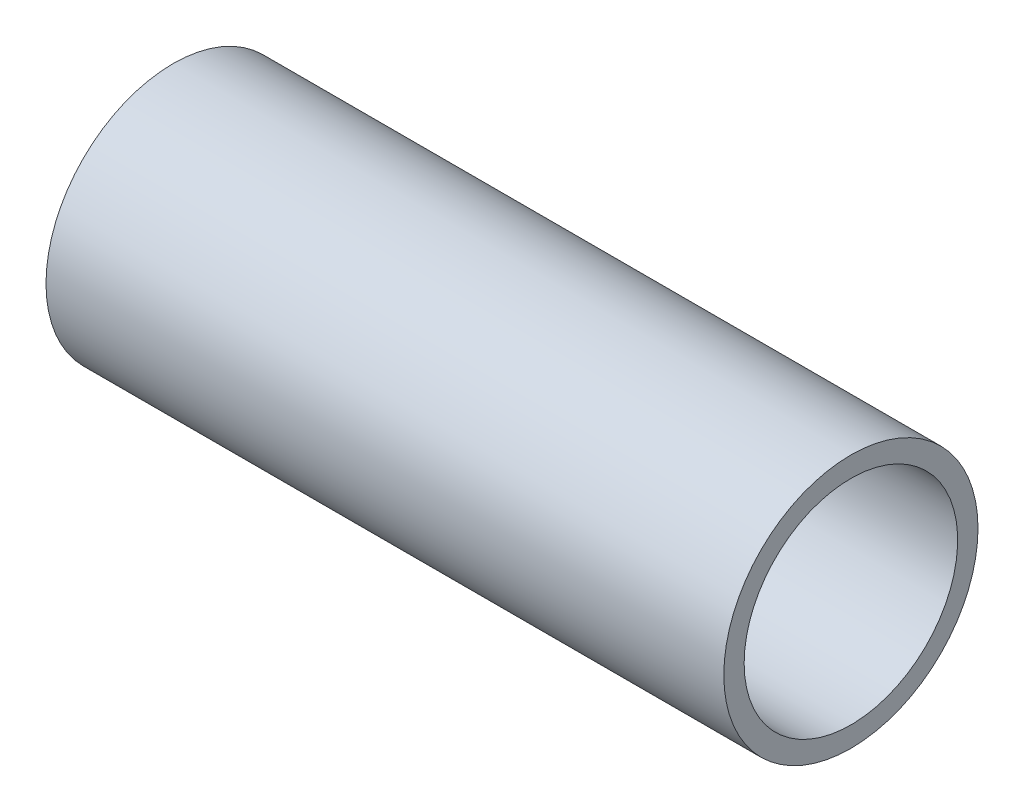
ISO-10303-21;
HEADER;
FILE_DESCRIPTION(('STEP AP214'),'2;1');
FILE_NAME('part.step','',(''),(''),'','','');
FILE_SCHEMA(('AUTOMOTIVE_DESIGN { 1 0 10303 214 1 1 1 1 }'));
ENDSEC;
DATA;
#1=APPLICATION_CONTEXT('core data for automotive mechanical design processes');
#2=APPLICATION_PROTOCOL_DEFINITION('international standard','automotive_design',2000,#1);
#3=PRODUCT_CONTEXT('',#1,'mechanical');
#4=PRODUCT('Part','Part','',(#3));
#5=PRODUCT_RELATED_PRODUCT_CATEGORY('part','',(#4));
#6=PRODUCT_DEFINITION_FORMATION('','',#4);
#7=PRODUCT_DEFINITION_CONTEXT('part definition',#1,'design');
#8=PRODUCT_DEFINITION('design','',#6,#7);
#9=PRODUCT_DEFINITION_SHAPE('','',#8);
#10=(LENGTH_UNIT() NAMED_UNIT(*) SI_UNIT(.MILLI.,.METRE.));
#11=(NAMED_UNIT(*) PLANE_ANGLE_UNIT() SI_UNIT($,.RADIAN.));
#12=(NAMED_UNIT(*) SI_UNIT($,.STERADIAN.) SOLID_ANGLE_UNIT());
#13=UNCERTAINTY_MEASURE_WITH_UNIT(LENGTH_MEASURE(1.E-05),#10,'distance_accuracy_value','');
#14=(GEOMETRIC_REPRESENTATION_CONTEXT(3) GLOBAL_UNCERTAINTY_ASSIGNED_CONTEXT((#13)) GLOBAL_UNIT_ASSIGNED_CONTEXT((#10,
#11,#12)) REPRESENTATION_CONTEXT('',''));
#15=CARTESIAN_POINT('',(0.,0.,0.));
#16=DIRECTION('',(0.,0.,1.));
#17=DIRECTION('',(1.,0.,0.));
#18=AXIS2_PLACEMENT_3D('',#15,#16,#17);
#19=CARTESIAN_POINT('',(50.8,0.,0.));
#20=DIRECTION('',(-1.,0.,0.));
#21=DIRECTION('',(0.,0.,1.));
#22=AXIS2_PLACEMENT_3D('',#19,#20,#21);
#23=CYLINDRICAL_SURFACE('',#22,9.525);
#24=CARTESIAN_POINT('',(50.8,0.,0.));
#25=DIRECTION('',(1.,0.,0.));
#26=DIRECTION('',(0.,0.,-1.));
#27=AXIS2_PLACEMENT_3D('',#24,#25,#26);
#28=CIRCLE('',#27,9.525);
#29=CARTESIAN_POINT('',(50.8,0.,-9.525));
#30=VERTEX_POINT('',#29);
#31=EDGE_CURVE('E10',#30,#30,#28,.T.);
#32=ORIENTED_EDGE('',*,*,#31,.F.);
#33=EDGE_LOOP('',(#32));
#34=FACE_BOUND('',#33,.T.);
#35=CARTESIAN_POINT('',(0.,0.,0.));
#36=DIRECTION('',(1.,0.,0.));
#37=DIRECTION('',(0.,0.,-1.));
#38=AXIS2_PLACEMENT_3D('',#35,#36,#37);
#39=CIRCLE('',#38,9.525);
#40=CARTESIAN_POINT('',(0.,0.,-9.525));
#41=VERTEX_POINT('',#40);
#42=EDGE_CURVE('E35',#41,#41,#39,.T.);
#43=ORIENTED_EDGE('',*,*,#42,.T.);
#44=EDGE_LOOP('',(#43));
#45=FACE_BOUND('',#44,.T.);
#46=ADVANCED_FACE('F32',(#34,#45),#23,.T.);
#47=CARTESIAN_POINT('',(50.8,0.,0.));
#48=DIRECTION('',(1.,0.,0.));
#49=DIRECTION('',(0.,0.,-1.));
#50=AXIS2_PLACEMENT_3D('',#47,#48,#49);
#51=PLANE('',#50);
#52=CARTESIAN_POINT('',(50.8,0.,0.));
#53=DIRECTION('',(-1.,0.,0.));
#54=DIRECTION('',(0.,0.,1.));
#55=AXIS2_PLACEMENT_3D('',#52,#53,#54);
#56=CIRCLE('',#55,8.001);
#57=CARTESIAN_POINT('',(50.8,0.,8.001));
#58=VERTEX_POINT('',#57);
#59=EDGE_CURVE('E47',#58,#58,#56,.T.);
#60=ORIENTED_EDGE('',*,*,#59,.T.);
#61=EDGE_LOOP('',(#60));
#62=FACE_BOUND('',#61,.T.);
#63=ORIENTED_EDGE('',*,*,#31,.T.);
#64=EDGE_LOOP('',(#63));
#65=FACE_BOUND('',#64,.T.);
#66=ADVANCED_FACE('F56',(#62,#65),#51,.T.);
#67=CARTESIAN_POINT('',(0.,0.,0.));
#68=DIRECTION('',(1.,0.,0.));
#69=DIRECTION('',(0.,0.,-1.));
#70=AXIS2_PLACEMENT_3D('',#67,#68,#69);
#71=PLANE('',#70);
#72=CARTESIAN_POINT('',(0.,0.,0.));
#73=DIRECTION('',(-1.,0.,0.));
#74=DIRECTION('',(0.,0.,1.));
#75=AXIS2_PLACEMENT_3D('',#72,#73,#74);
#76=CIRCLE('',#75,8.509);
#77=CARTESIAN_POINT('',(0.,0.,8.509));
#78=VERTEX_POINT('',#77);
#79=EDGE_CURVE('E44',#78,#78,#76,.T.);
#80=ORIENTED_EDGE('',*,*,#79,.F.);
#81=EDGE_LOOP('',(#80));
#82=FACE_BOUND('',#81,.T.);
#83=ORIENTED_EDGE('',*,*,#42,.F.);
#84=EDGE_LOOP('',(#83));
#85=FACE_BOUND('',#84,.T.);
#86=ADVANCED_FACE('F73',(#82,#85),#71,.F.);
#87=CARTESIAN_POINT('',(1.524,0.,0.));
#88=DIRECTION('',(-1.,0.,0.));
#89=DIRECTION('',(0.,0.,1.));
#90=AXIS2_PLACEMENT_3D('',#87,#88,#89);
#91=CYLINDRICAL_SURFACE('',#90,8.509);
#92=CARTESIAN_POINT('',(1.524,0.,0.));
#93=DIRECTION('',(-1.,0.,0.));
#94=DIRECTION('',(0.,0.,1.));
#95=AXIS2_PLACEMENT_3D('',#92,#93,#94);
#96=CIRCLE('',#95,8.509);
#97=CARTESIAN_POINT('',(1.524,0.,8.509));
#98=VERTEX_POINT('',#97);
#99=EDGE_CURVE('E42',#98,#98,#96,.T.);
#100=ORIENTED_EDGE('',*,*,#99,.F.);
#101=EDGE_LOOP('',(#100));
#102=FACE_BOUND('',#101,.T.);
#103=ORIENTED_EDGE('',*,*,#79,.T.);
#104=EDGE_LOOP('',(#103));
#105=FACE_BOUND('',#104,.T.);
#106=ADVANCED_FACE('F67',(#102,#105),#91,.F.);
#107=CARTESIAN_POINT('',(1.524,0.,0.));
#108=DIRECTION('',(-1.,0.,0.));
#109=DIRECTION('',(0.,0.,1.));
#110=AXIS2_PLACEMENT_3D('',#107,#108,#109);
#111=PLANE('',#110);
#112=CARTESIAN_POINT('',(1.524,0.,0.));
#113=DIRECTION('',(-1.,0.,0.));
#114=DIRECTION('',(0.,0.,1.));
#115=AXIS2_PLACEMENT_3D('',#112,#113,#114);
#116=CIRCLE('',#115,8.001);
#117=CARTESIAN_POINT('',(1.524,0.,8.001));
#118=VERTEX_POINT('',#117);
#119=EDGE_CURVE('E50',#118,#118,#116,.T.);
#120=ORIENTED_EDGE('',*,*,#119,.F.);
#121=EDGE_LOOP('',(#120));
#122=FACE_BOUND('',#121,.T.);
#123=ORIENTED_EDGE('',*,*,#99,.T.);
#124=EDGE_LOOP('',(#123));
#125=FACE_BOUND('',#124,.T.);
#126=ADVANCED_FACE('F61',(#122,#125),#111,.T.);
#127=CARTESIAN_POINT('',(50.8,0.,0.));
#128=DIRECTION('',(-1.,0.,0.));
#129=DIRECTION('',(0.,0.,1.));
#130=AXIS2_PLACEMENT_3D('',#127,#128,#129);
#131=CYLINDRICAL_SURFACE('',#130,8.001);
#132=ORIENTED_EDGE('',*,*,#59,.F.);
#133=EDGE_LOOP('',(#132));
#134=FACE_BOUND('',#133,.T.);
#135=ORIENTED_EDGE('',*,*,#119,.T.);
#136=EDGE_LOOP('',(#135));
#137=FACE_BOUND('',#136,.T.);
#138=ADVANCED_FACE('F58',(#134,#137),#131,.F.);
#139=CLOSED_SHELL('',(#46,#66,#86,#106,#126,#138));
#140=MANIFOLD_SOLID_BREP('B2',#139);
#141=ADVANCED_BREP_SHAPE_REPRESENTATION('',(#18,#140),#14);
#142=SHAPE_DEFINITION_REPRESENTATION(#9,#141);
ENDSEC;
END-ISO-10303-21;
